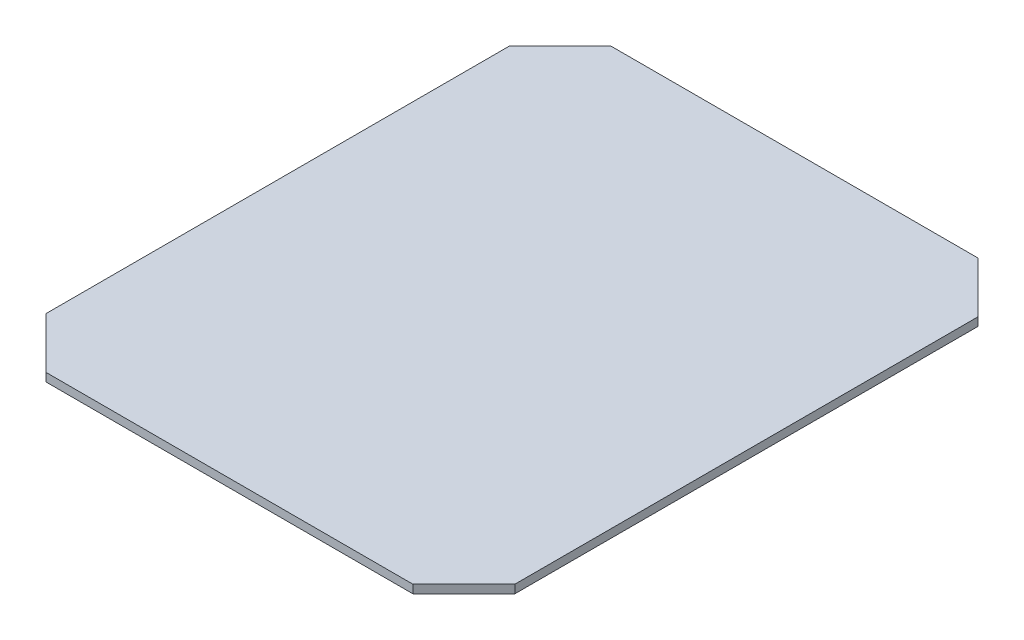
ISO-10303-21;
HEADER;
FILE_DESCRIPTION(('STEP AP214'),'2;1');
FILE_NAME('part.step','',(''),(''),'','','');
FILE_SCHEMA(('AUTOMOTIVE_DESIGN { 1 0 10303 214 1 1 1 1 }'));
ENDSEC;
DATA;
#1=APPLICATION_CONTEXT('core data for automotive mechanical design processes');
#2=APPLICATION_PROTOCOL_DEFINITION('international standard','automotive_design',2000,#1);
#3=PRODUCT_CONTEXT('',#1,'mechanical');
#4=PRODUCT('Part','Part','',(#3));
#5=PRODUCT_RELATED_PRODUCT_CATEGORY('part','',(#4));
#6=PRODUCT_DEFINITION_FORMATION('','',#4);
#7=PRODUCT_DEFINITION_CONTEXT('part definition',#1,'design');
#8=PRODUCT_DEFINITION('design','',#6,#7);
#9=PRODUCT_DEFINITION_SHAPE('','',#8);
#10=(LENGTH_UNIT() NAMED_UNIT(*) SI_UNIT(.MILLI.,.METRE.));
#11=(NAMED_UNIT(*) PLANE_ANGLE_UNIT() SI_UNIT($,.RADIAN.));
#12=(NAMED_UNIT(*) SI_UNIT($,.STERADIAN.) SOLID_ANGLE_UNIT());
#13=UNCERTAINTY_MEASURE_WITH_UNIT(LENGTH_MEASURE(1.E-05),#10,'distance_accuracy_value','');
#14=(GEOMETRIC_REPRESENTATION_CONTEXT(3) GLOBAL_UNCERTAINTY_ASSIGNED_CONTEXT((#13)) GLOBAL_UNIT_ASSIGNED_CONTEXT((#10,
#11,#12)) REPRESENTATION_CONTEXT('',''));
#15=CARTESIAN_POINT('',(0.,0.,0.));
#16=DIRECTION('',(0.,0.,1.));
#17=DIRECTION('',(1.,0.,0.));
#18=AXIS2_PLACEMENT_3D('',#15,#16,#17);
#19=CARTESIAN_POINT('',(0.,9.,0.));
#20=DIRECTION('',(1.,0.,0.));
#21=DIRECTION('',(0.,0.,-1.));
#22=AXIS2_PLACEMENT_3D('',#19,#20,#21);
#23=PLANE('',#22);
#24=DIRECTION('',(0.,0.,1.));
#25=VECTOR('',#24,1.);
#26=CARTESIAN_POINT('',(0.,9.,0.));
#27=LINE('',#26,#25);
#28=CARTESIAN_POINT('',(-2.22044604925031E-13,9.,-555.5));
#29=VERTEX_POINT('',#28);
#30=CARTESIAN_POINT('',(-2.22044604925031E-13,9.,-55.));
#31=VERTEX_POINT('',#30);
#32=EDGE_CURVE('E125',#29,#31,#27,.T.);
#33=ORIENTED_EDGE('',*,*,#32,.F.);
#34=DIRECTION('',(0.,1.,0.));
#35=VECTOR('',#34,1.);
#36=CARTESIAN_POINT('',(-2.22044604925031E-13,0.,-555.5));
#37=LINE('',#36,#35);
#38=CARTESIAN_POINT('',(-2.22044604925031E-13,0.,-555.5));
#39=VERTEX_POINT('',#38);
#40=EDGE_CURVE('E158',#39,#29,#37,.T.);
#41=ORIENTED_EDGE('',*,*,#40,.F.);
#42=DIRECTION('',(0.,0.,1.));
#43=VECTOR('',#42,1.);
#44=CARTESIAN_POINT('',(0.,0.,0.));
#45=LINE('',#44,#43);
#46=CARTESIAN_POINT('',(0.,0.,-54.9999999999998));
#47=VERTEX_POINT('',#46);
#48=EDGE_CURVE('E131',#39,#47,#45,.T.);
#49=ORIENTED_EDGE('',*,*,#48,.T.);
#50=DIRECTION('',(0.,1.,0.));
#51=VECTOR('',#50,1.);
#52=CARTESIAN_POINT('',(-2.22044604925031E-13,0.,-55.));
#53=LINE('',#52,#51);
#54=EDGE_CURVE('E134',#47,#31,#53,.T.);
#55=ORIENTED_EDGE('',*,*,#54,.T.);
#56=EDGE_LOOP('',(#33,#41,#49,#55));
#57=FACE_BOUND('',#56,.T.);
#58=ADVANCED_FACE('F37',(#57),#23,.F.);
#59=CARTESIAN_POINT('',(0.,9.,0.));
#60=DIRECTION('',(0.,0.,-1.));
#61=DIRECTION('',(-1.,0.,0.));
#62=AXIS2_PLACEMENT_3D('',#59,#60,#61);
#63=PLANE('',#62);
#64=DIRECTION('',(1.,0.,0.));
#65=VECTOR('',#64,1.);
#66=CARTESIAN_POINT('',(0.,0.,0.));
#67=LINE('',#66,#65);
#68=CARTESIAN_POINT('',(55.,0.,0.));
#69=VERTEX_POINT('',#68);
#70=CARTESIAN_POINT('',(451.5,0.,0.));
#71=VERTEX_POINT('',#70);
#72=EDGE_CURVE('E119',#69,#71,#67,.T.);
#73=ORIENTED_EDGE('',*,*,#72,.T.);
#74=DIRECTION('',(0.,1.,0.));
#75=VECTOR('',#74,1.);
#76=CARTESIAN_POINT('',(451.5,0.,0.));
#77=LINE('',#76,#75);
#78=CARTESIAN_POINT('',(451.5,9.,0.));
#79=VERTEX_POINT('',#78);
#80=EDGE_CURVE('E53',#71,#79,#77,.T.);
#81=ORIENTED_EDGE('',*,*,#80,.T.);
#82=DIRECTION('',(1.,0.,0.));
#83=VECTOR('',#82,1.);
#84=CARTESIAN_POINT('',(0.,9.,0.));
#85=LINE('',#84,#83);
#86=CARTESIAN_POINT('',(55.,9.,0.));
#87=VERTEX_POINT('',#86);
#88=EDGE_CURVE('E117',#87,#79,#85,.T.);
#89=ORIENTED_EDGE('',*,*,#88,.F.);
#90=DIRECTION('',(0.,1.,0.));
#91=VECTOR('',#90,1.);
#92=CARTESIAN_POINT('',(55.,0.,0.));
#93=LINE('',#92,#91);
#94=EDGE_CURVE('E166',#69,#87,#93,.T.);
#95=ORIENTED_EDGE('',*,*,#94,.F.);
#96=EDGE_LOOP('',(#73,#81,#89,#95));
#97=FACE_BOUND('',#96,.T.);
#98=ADVANCED_FACE('F115',(#97),#63,.F.);
#99=CARTESIAN_POINT('',(506.5,9.,0.));
#100=DIRECTION('',(-1.,0.,0.));
#101=DIRECTION('',(0.,0.,1.));
#102=AXIS2_PLACEMENT_3D('',#99,#100,#101);
#103=PLANE('',#102);
#104=DIRECTION('',(0.,0.,-1.));
#105=VECTOR('',#104,1.);
#106=CARTESIAN_POINT('',(506.5,0.,0.));
#107=LINE('',#106,#105);
#108=CARTESIAN_POINT('',(506.5,0.,-55.));
#109=VERTEX_POINT('',#108);
#110=CARTESIAN_POINT('',(506.5,0.,-555.5));
#111=VERTEX_POINT('',#110);
#112=EDGE_CURVE('E135',#109,#111,#107,.T.);
#113=ORIENTED_EDGE('',*,*,#112,.T.);
#114=DIRECTION('',(0.,1.,0.));
#115=VECTOR('',#114,1.);
#116=CARTESIAN_POINT('',(506.5,0.,-555.5));
#117=LINE('',#116,#115);
#118=CARTESIAN_POINT('',(506.5,9.,-555.5));
#119=VERTEX_POINT('',#118);
#120=EDGE_CURVE('E61',#111,#119,#117,.T.);
#121=ORIENTED_EDGE('',*,*,#120,.T.);
#122=DIRECTION('',(0.,0.,-1.));
#123=VECTOR('',#122,1.);
#124=CARTESIAN_POINT('',(506.5,9.,0.));
#125=LINE('',#124,#123);
#126=CARTESIAN_POINT('',(506.5,9.,-55.));
#127=VERTEX_POINT('',#126);
#128=EDGE_CURVE('E45',#127,#119,#125,.T.);
#129=ORIENTED_EDGE('',*,*,#128,.F.);
#130=DIRECTION('',(0.,1.,0.));
#131=VECTOR('',#130,1.);
#132=CARTESIAN_POINT('',(506.5,0.,-55.));
#133=LINE('',#132,#131);
#134=EDGE_CURVE('E104',#109,#127,#133,.T.);
#135=ORIENTED_EDGE('',*,*,#134,.F.);
#136=EDGE_LOOP('',(#113,#121,#129,#135));
#137=FACE_BOUND('',#136,.T.);
#138=ADVANCED_FACE('F179',(#137),#103,.F.);
#139=CARTESIAN_POINT('',(-2.22044604925031E-13,9.,-610.5));
#140=DIRECTION('',(0.,0.,1.));
#141=DIRECTION('',(1.,0.,0.));
#142=AXIS2_PLACEMENT_3D('',#139,#140,#141);
#143=PLANE('',#142);
#144=DIRECTION('',(-1.,0.,0.));
#145=VECTOR('',#144,1.);
#146=CARTESIAN_POINT('',(-2.22044604925031E-13,0.,-610.5));
#147=LINE('',#146,#145);
#148=CARTESIAN_POINT('',(451.5,0.,-610.5));
#149=VERTEX_POINT('',#148);
#150=CARTESIAN_POINT('',(54.9999999999999,0.,-610.5));
#151=VERTEX_POINT('',#150);
#152=EDGE_CURVE('E40',#149,#151,#147,.T.);
#153=ORIENTED_EDGE('',*,*,#152,.T.);
#154=DIRECTION('',(0.,1.,0.));
#155=VECTOR('',#154,1.);
#156=CARTESIAN_POINT('',(54.9999999999998,0.,-610.5));
#157=LINE('',#156,#155);
#158=CARTESIAN_POINT('',(54.9999999999998,9.,-610.5));
#159=VERTEX_POINT('',#158);
#160=EDGE_CURVE('E146',#151,#159,#157,.T.);
#161=ORIENTED_EDGE('',*,*,#160,.T.);
#162=DIRECTION('',(-1.,0.,0.));
#163=VECTOR('',#162,1.);
#164=CARTESIAN_POINT('',(-2.22044604925031E-13,9.,-610.5));
#165=LINE('',#164,#163);
#166=CARTESIAN_POINT('',(451.5,9.,-610.5));
#167=VERTEX_POINT('',#166);
#168=EDGE_CURVE('E11',#167,#159,#165,.T.);
#169=ORIENTED_EDGE('',*,*,#168,.F.);
#170=DIRECTION('',(0.,1.,0.));
#171=VECTOR('',#170,1.);
#172=CARTESIAN_POINT('',(451.5,0.,-610.5));
#173=LINE('',#172,#171);
#174=EDGE_CURVE('E147',#149,#167,#173,.T.);
#175=ORIENTED_EDGE('',*,*,#174,.F.);
#176=EDGE_LOOP('',(#153,#161,#169,#175));
#177=FACE_BOUND('',#176,.T.);
#178=ADVANCED_FACE('F144',(#177),#143,.F.);
#179=CARTESIAN_POINT('',(0.,9.,0.));
#180=DIRECTION('',(0.,-1.,0.));
#181=DIRECTION('',(0.,0.,-1.));
#182=AXIS2_PLACEMENT_3D('',#179,#180,#181);
#183=PLANE('',#182);
#184=ORIENTED_EDGE('',*,*,#168,.T.);
#185=DIRECTION('',(0.707106781186547,0.,-0.707106781186548));
#186=VECTOR('',#185,1.);
#187=CARTESIAN_POINT('',(54.9999999999998,9.,-610.5));
#188=LINE('',#187,#186);
#189=EDGE_CURVE('E157',#29,#159,#188,.T.);
#190=ORIENTED_EDGE('',*,*,#189,.F.);
#191=ORIENTED_EDGE('',*,*,#32,.T.);
#192=DIRECTION('',(-0.707106781186549,0.,-0.707106781186546));
#193=VECTOR('',#192,1.);
#194=CARTESIAN_POINT('',(55.,9.,0.));
#195=LINE('',#194,#193);
#196=EDGE_CURVE('E109',#87,#31,#195,.T.);
#197=ORIENTED_EDGE('',*,*,#196,.F.);
#198=ORIENTED_EDGE('',*,*,#88,.T.);
#199=DIRECTION('',(-0.707106781186547,0.,0.707106781186548));
#200=VECTOR('',#199,1.);
#201=CARTESIAN_POINT('',(451.5,9.,0.));
#202=LINE('',#201,#200);
#203=EDGE_CURVE('E101',#127,#79,#202,.T.);
#204=ORIENTED_EDGE('',*,*,#203,.F.);
#205=ORIENTED_EDGE('',*,*,#128,.T.);
#206=DIRECTION('',(0.707106781186549,0.,0.707106781186546));
#207=VECTOR('',#206,1.);
#208=CARTESIAN_POINT('',(506.5,9.,-555.5));
#209=LINE('',#208,#207);
#210=EDGE_CURVE('E120',#167,#119,#209,.T.);
#211=ORIENTED_EDGE('',*,*,#210,.F.);
#212=EDGE_LOOP('',(#184,#190,#191,#197,#198,#204,#205,#211));
#213=FACE_BOUND('',#212,.T.);
#214=ADVANCED_FACE('F123',(#213),#183,.F.);
#215=CARTESIAN_POINT('',(0.,0.,0.));
#216=DIRECTION('',(0.,-1.,0.));
#217=DIRECTION('',(0.,0.,-1.));
#218=AXIS2_PLACEMENT_3D('',#215,#216,#217);
#219=PLANE('',#218);
#220=DIRECTION('',(0.707106781186547,0.,-0.707106781186548));
#221=VECTOR('',#220,1.);
#222=CARTESIAN_POINT('',(54.9999999999998,0.,-610.5));
#223=LINE('',#222,#221);
#224=EDGE_CURVE('E153',#39,#151,#223,.T.);
#225=ORIENTED_EDGE('',*,*,#224,.T.);
#226=ORIENTED_EDGE('',*,*,#152,.F.);
#227=DIRECTION('',(0.707106781186549,0.,0.707106781186546));
#228=VECTOR('',#227,1.);
#229=CARTESIAN_POINT('',(506.5,0.,-555.5));
#230=LINE('',#229,#228);
#231=EDGE_CURVE('E151',#149,#111,#230,.T.);
#232=ORIENTED_EDGE('',*,*,#231,.T.);
#233=ORIENTED_EDGE('',*,*,#112,.F.);
#234=DIRECTION('',(-0.707106781186547,0.,0.707106781186548));
#235=VECTOR('',#234,1.);
#236=CARTESIAN_POINT('',(451.5,0.,0.));
#237=LINE('',#236,#235);
#238=EDGE_CURVE('E110',#109,#71,#237,.T.);
#239=ORIENTED_EDGE('',*,*,#238,.T.);
#240=ORIENTED_EDGE('',*,*,#72,.F.);
#241=DIRECTION('',(-0.707106781186549,0.,-0.707106781186546));
#242=VECTOR('',#241,1.);
#243=CARTESIAN_POINT('',(55.,0.,0.));
#244=LINE('',#243,#242);
#245=EDGE_CURVE('E164',#69,#47,#244,.T.);
#246=ORIENTED_EDGE('',*,*,#245,.T.);
#247=ORIENTED_EDGE('',*,*,#48,.F.);
#248=EDGE_LOOP('',(#225,#226,#232,#233,#239,#240,#246,#247));
#249=FACE_BOUND('',#248,.T.);
#250=ADVANCED_FACE('F150',(#249),#219,.T.);
#251=CARTESIAN_POINT('',(55.,0.,0.));
#252=DIRECTION('',(0.707106781186546,0.,-0.707106781186549));
#253=DIRECTION('',(-0.707106781186549,0.,-0.707106781186546));
#254=AXIS2_PLACEMENT_3D('',#251,#252,#253);
#255=PLANE('',#254);
#256=ORIENTED_EDGE('',*,*,#196,.T.);
#257=ORIENTED_EDGE('',*,*,#54,.F.);
#258=ORIENTED_EDGE('',*,*,#245,.F.);
#259=ORIENTED_EDGE('',*,*,#94,.T.);
#260=EDGE_LOOP('',(#256,#257,#258,#259));
#261=FACE_BOUND('',#260,.T.);
#262=ADVANCED_FACE('F170',(#261),#255,.F.);
#263=CARTESIAN_POINT('',(451.5,0.,0.));
#264=DIRECTION('',(-0.707106781186548,0.,-0.707106781186547));
#265=DIRECTION('',(-0.707106781186547,0.,0.707106781186548));
#266=AXIS2_PLACEMENT_3D('',#263,#264,#265);
#267=PLANE('',#266);
#268=ORIENTED_EDGE('',*,*,#203,.T.);
#269=ORIENTED_EDGE('',*,*,#80,.F.);
#270=ORIENTED_EDGE('',*,*,#238,.F.);
#271=ORIENTED_EDGE('',*,*,#134,.T.);
#272=EDGE_LOOP('',(#268,#269,#270,#271));
#273=FACE_BOUND('',#272,.T.);
#274=ADVANCED_FACE('F102',(#273),#267,.F.);
#275=CARTESIAN_POINT('',(506.5,0.,-555.5));
#276=DIRECTION('',(-0.707106781186546,0.,0.707106781186549));
#277=DIRECTION('',(0.707106781186549,0.,0.707106781186546));
#278=AXIS2_PLACEMENT_3D('',#275,#276,#277);
#279=PLANE('',#278);
#280=ORIENTED_EDGE('',*,*,#210,.T.);
#281=ORIENTED_EDGE('',*,*,#120,.F.);
#282=ORIENTED_EDGE('',*,*,#231,.F.);
#283=ORIENTED_EDGE('',*,*,#174,.T.);
#284=EDGE_LOOP('',(#280,#281,#282,#283));
#285=FACE_BOUND('',#284,.T.);
#286=ADVANCED_FACE('F178',(#285),#279,.F.);
#287=CARTESIAN_POINT('',(54.9999999999998,0.,-610.5));
#288=DIRECTION('',(0.707106781186548,0.,0.707106781186547));
#289=DIRECTION('',(0.707106781186547,0.,-0.707106781186548));
#290=AXIS2_PLACEMENT_3D('',#287,#288,#289);
#291=PLANE('',#290);
#292=ORIENTED_EDGE('',*,*,#189,.T.);
#293=ORIENTED_EDGE('',*,*,#160,.F.);
#294=ORIENTED_EDGE('',*,*,#224,.F.);
#295=ORIENTED_EDGE('',*,*,#40,.T.);
#296=EDGE_LOOP('',(#292,#293,#294,#295));
#297=FACE_BOUND('',#296,.T.);
#298=ADVANCED_FACE('F193',(#297),#291,.F.);
#299=CLOSED_SHELL('',(#58,#98,#138,#178,#214,#250,#262,#274,#286,#298));
#300=MANIFOLD_SOLID_BREP('B2',#299);
#301=ADVANCED_BREP_SHAPE_REPRESENTATION('',(#18,#300),#14);
#302=SHAPE_DEFINITION_REPRESENTATION(#9,#301);
ENDSEC;
END-ISO-10303-21;
